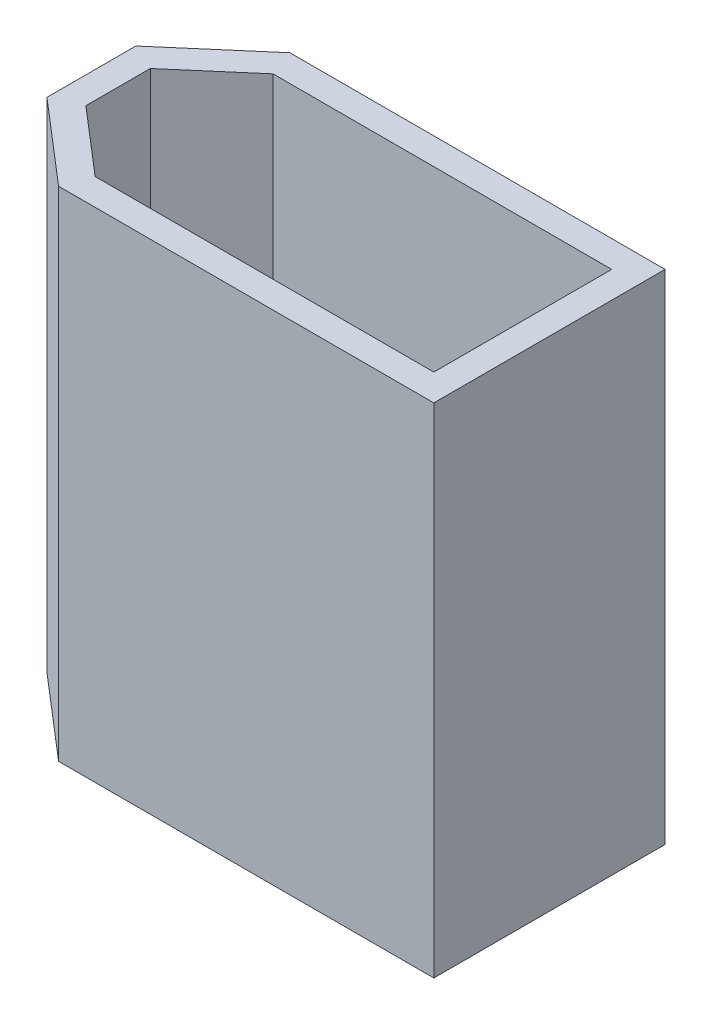
ISO-10303-21;
HEADER;
FILE_DESCRIPTION(('STEP AP214'),'2;1');
FILE_NAME('part.step','',(''),(''),'','','');
FILE_SCHEMA(('AUTOMOTIVE_DESIGN { 1 0 10303 214 1 1 1 1 }'));
ENDSEC;
DATA;
#1=APPLICATION_CONTEXT('core data for automotive mechanical design processes');
#2=APPLICATION_PROTOCOL_DEFINITION('international standard','automotive_design',2000,#1);
#3=PRODUCT_CONTEXT('',#1,'mechanical');
#4=PRODUCT('Part','Part','',(#3));
#5=PRODUCT_RELATED_PRODUCT_CATEGORY('part','',(#4));
#6=PRODUCT_DEFINITION_FORMATION('','',#4);
#7=PRODUCT_DEFINITION_CONTEXT('part definition',#1,'design');
#8=PRODUCT_DEFINITION('design','',#6,#7);
#9=PRODUCT_DEFINITION_SHAPE('','',#8);
#10=(LENGTH_UNIT() NAMED_UNIT(*) SI_UNIT(.MILLI.,.METRE.));
#11=(NAMED_UNIT(*) PLANE_ANGLE_UNIT() SI_UNIT($,.RADIAN.));
#12=(NAMED_UNIT(*) SI_UNIT($,.STERADIAN.) SOLID_ANGLE_UNIT());
#13=UNCERTAINTY_MEASURE_WITH_UNIT(LENGTH_MEASURE(1.E-05),#10,'distance_accuracy_value','');
#14=(GEOMETRIC_REPRESENTATION_CONTEXT(3) GLOBAL_UNCERTAINTY_ASSIGNED_CONTEXT((#13)) GLOBAL_UNIT_ASSIGNED_CONTEXT((#10,
#11,#12)) REPRESENTATION_CONTEXT('',''));
#15=CARTESIAN_POINT('',(0.,0.,0.));
#16=DIRECTION('',(0.,0.,1.));
#17=DIRECTION('',(1.,0.,0.));
#18=AXIS2_PLACEMENT_3D('',#15,#16,#17);
#19=CARTESIAN_POINT('',(0.,11.2,0.));
#20=DIRECTION('',(0.,1.,0.));
#21=DIRECTION('',(0.,0.,1.));
#22=AXIS2_PLACEMENT_3D('',#19,#20,#21);
#23=PLANE('',#22);
#24=DIRECTION('',(0.,0.,-1.));
#25=VECTOR('',#24,1.);
#26=CARTESIAN_POINT('',(5.15,11.2,2.6));
#27=LINE('',#26,#25);
#28=CARTESIAN_POINT('',(5.15,11.2,2.6));
#29=VERTEX_POINT('',#28);
#30=CARTESIAN_POINT('',(5.15,11.2,-2.6));
#31=VERTEX_POINT('',#30);
#32=EDGE_CURVE('E174',#29,#31,#27,.T.);
#33=ORIENTED_EDGE('',*,*,#32,.T.);
#34=DIRECTION('',(-1.,0.,0.));
#35=VECTOR('',#34,1.);
#36=CARTESIAN_POINT('',(5.15,11.2,-2.6));
#37=LINE('',#36,#35);
#38=CARTESIAN_POINT('',(-3.28806115864613,11.2,-2.6));
#39=VERTEX_POINT('',#38);
#40=EDGE_CURVE('E177',#31,#39,#37,.T.);
#41=ORIENTED_EDGE('',*,*,#40,.T.);
#42=DIRECTION('',(-0.758440361342966,0.,0.651742447816583));
#43=VECTOR('',#42,1.);
#44=CARTESIAN_POINT('',(-3.28806115864613,11.2,-2.6));
#45=LINE('',#44,#43);
#46=CARTESIAN_POINT('',(-5.15,11.2,-1.));
#47=VERTEX_POINT('',#46);
#48=EDGE_CURVE('E180',#39,#47,#45,.T.);
#49=ORIENTED_EDGE('',*,*,#48,.T.);
#50=DIRECTION('',(0.,0.,1.));
#51=VECTOR('',#50,1.);
#52=CARTESIAN_POINT('',(-5.15,11.2,1.));
#53=LINE('',#52,#51);
#54=CARTESIAN_POINT('',(-5.15,11.2,1.));
#55=VERTEX_POINT('',#54);
#56=EDGE_CURVE('E182',#47,#55,#53,.T.);
#57=ORIENTED_EDGE('',*,*,#56,.T.);
#58=DIRECTION('',(0.758440361342965,0.,0.651742447816583));
#59=VECTOR('',#58,1.);
#60=CARTESIAN_POINT('',(-3.28806115864613,11.2,2.6));
#61=LINE('',#60,#59);
#62=CARTESIAN_POINT('',(-3.28806115864613,11.2,2.6));
#63=VERTEX_POINT('',#62);
#64=EDGE_CURVE('E184',#55,#63,#61,.T.);
#65=ORIENTED_EDGE('',*,*,#64,.T.);
#66=DIRECTION('',(1.,0.,0.));
#67=VECTOR('',#66,1.);
#68=CARTESIAN_POINT('',(5.15,11.2,2.6));
#69=LINE('',#68,#67);
#70=EDGE_CURVE('E186',#63,#29,#69,.T.);
#71=ORIENTED_EDGE('',*,*,#70,.T.);
#72=EDGE_LOOP('',(#33,#41,#49,#57,#65,#71));
#73=FACE_BOUND('',#72,.T.);
#74=DIRECTION('',(-1.,0.,0.));
#75=VECTOR('',#74,1.);
#76=CARTESIAN_POINT('',(4.55,11.2,-2.));
#77=LINE('',#76,#75);
#78=CARTESIAN_POINT('',(4.55,11.2,-2.));
#79=VERTEX_POINT('',#78);
#80=CARTESIAN_POINT('',(-3.06567916760078,11.2,-2.));
#81=VERTEX_POINT('',#80);
#82=EDGE_CURVE('E131',#79,#81,#77,.T.);
#83=ORIENTED_EDGE('',*,*,#82,.F.);
#84=DIRECTION('',(0.,0.,-1.));
#85=VECTOR('',#84,1.);
#86=CARTESIAN_POINT('',(4.55,11.2,2.));
#87=LINE('',#86,#85);
#88=CARTESIAN_POINT('',(4.55,11.2,2.));
#89=VERTEX_POINT('',#88);
#90=EDGE_CURVE('E123',#89,#79,#87,.T.);
#91=ORIENTED_EDGE('',*,*,#90,.F.);
#92=DIRECTION('',(1.,0.,0.));
#93=VECTOR('',#92,1.);
#94=CARTESIAN_POINT('',(4.55,11.2,2.));
#95=LINE('',#94,#93);
#96=CARTESIAN_POINT('',(-3.06567916760078,11.2,2.));
#97=VERTEX_POINT('',#96);
#98=EDGE_CURVE('E152',#97,#89,#95,.T.);
#99=ORIENTED_EDGE('',*,*,#98,.F.);
#100=DIRECTION('',(0.758440361342966,0.,0.651742447816583));
#101=VECTOR('',#100,1.);
#102=CARTESIAN_POINT('',(-3.06567916760078,11.2,2.));
#103=LINE('',#102,#101);
#104=CARTESIAN_POINT('',(-4.55,11.2,0.724494446814439));
#105=VERTEX_POINT('',#104);
#106=EDGE_CURVE('E150',#105,#97,#103,.T.);
#107=ORIENTED_EDGE('',*,*,#106,.F.);
#108=DIRECTION('',(0.,0.,1.));
#109=VECTOR('',#108,1.);
#110=CARTESIAN_POINT('',(-4.55,11.2,0.724494446814439));
#111=LINE('',#110,#109);
#112=CARTESIAN_POINT('',(-4.55,11.2,-0.72449444681444));
#113=VERTEX_POINT('',#112);
#114=EDGE_CURVE('E146',#113,#105,#111,.T.);
#115=ORIENTED_EDGE('',*,*,#114,.F.);
#116=DIRECTION('',(-0.758440361342966,0.,0.651742447816583));
#117=VECTOR('',#116,1.);
#118=CARTESIAN_POINT('',(-3.06567916760078,11.2,-2.));
#119=LINE('',#118,#117);
#120=EDGE_CURVE('E144',#81,#113,#119,.T.);
#121=ORIENTED_EDGE('',*,*,#120,.F.);
#122=EDGE_LOOP('',(#83,#91,#99,#107,#115,#121));
#123=FACE_BOUND('',#122,.T.);
#124=ADVANCED_FACE('F34',(#73,#123),#23,.T.);
#125=CARTESIAN_POINT('',(0.,0.,0.));
#126=DIRECTION('',(0.,1.,0.));
#127=DIRECTION('',(0.,0.,1.));
#128=AXIS2_PLACEMENT_3D('',#125,#126,#127);
#129=PLANE('',#128);
#130=DIRECTION('',(0.,0.,-1.));
#131=VECTOR('',#130,1.);
#132=CARTESIAN_POINT('',(5.15,0.,2.6));
#133=LINE('',#132,#131);
#134=CARTESIAN_POINT('',(5.15,0.,2.6));
#135=VERTEX_POINT('',#134);
#136=CARTESIAN_POINT('',(5.15,0.,-2.6));
#137=VERTEX_POINT('',#136);
#138=EDGE_CURVE('E139',#135,#137,#133,.T.);
#139=ORIENTED_EDGE('',*,*,#138,.F.);
#140=DIRECTION('',(1.,0.,0.));
#141=VECTOR('',#140,1.);
#142=CARTESIAN_POINT('',(5.15,0.,2.6));
#143=LINE('',#142,#141);
#144=CARTESIAN_POINT('',(-3.28806115864613,0.,2.6));
#145=VERTEX_POINT('',#144);
#146=EDGE_CURVE('E178',#145,#135,#143,.T.);
#147=ORIENTED_EDGE('',*,*,#146,.F.);
#148=DIRECTION('',(0.758440361342965,0.,0.651742447816583));
#149=VECTOR('',#148,1.);
#150=CARTESIAN_POINT('',(-3.28806115864613,0.,2.6));
#151=LINE('',#150,#149);
#152=CARTESIAN_POINT('',(-5.15,0.,1.));
#153=VERTEX_POINT('',#152);
#154=EDGE_CURVE('E197',#153,#145,#151,.T.);
#155=ORIENTED_EDGE('',*,*,#154,.F.);
#156=DIRECTION('',(0.,0.,1.));
#157=VECTOR('',#156,1.);
#158=CARTESIAN_POINT('',(-5.15,0.,1.));
#159=LINE('',#158,#157);
#160=CARTESIAN_POINT('',(-5.15,0.,-1.));
#161=VERTEX_POINT('',#160);
#162=EDGE_CURVE('E195',#161,#153,#159,.T.);
#163=ORIENTED_EDGE('',*,*,#162,.F.);
#164=DIRECTION('',(-0.758440361342966,0.,0.651742447816583));
#165=VECTOR('',#164,1.);
#166=CARTESIAN_POINT('',(-3.28806115864613,0.,-2.6));
#167=LINE('',#166,#165);
#168=CARTESIAN_POINT('',(-3.28806115864613,0.,-2.6));
#169=VERTEX_POINT('',#168);
#170=EDGE_CURVE('E193',#169,#161,#167,.T.);
#171=ORIENTED_EDGE('',*,*,#170,.F.);
#172=DIRECTION('',(-1.,0.,0.));
#173=VECTOR('',#172,1.);
#174=CARTESIAN_POINT('',(5.15,0.,-2.6));
#175=LINE('',#174,#173);
#176=EDGE_CURVE('E191',#137,#169,#175,.T.);
#177=ORIENTED_EDGE('',*,*,#176,.F.);
#178=EDGE_LOOP('',(#139,#147,#155,#163,#171,#177));
#179=FACE_BOUND('',#178,.T.);
#180=DIRECTION('',(0.,0.,-1.));
#181=VECTOR('',#180,1.);
#182=CARTESIAN_POINT('',(4.55,0.,2.));
#183=LINE('',#182,#181);
#184=CARTESIAN_POINT('',(4.55,0.,2.));
#185=VERTEX_POINT('',#184);
#186=CARTESIAN_POINT('',(4.55,0.,-2.));
#187=VERTEX_POINT('',#186);
#188=EDGE_CURVE('E57',#185,#187,#183,.T.);
#189=ORIENTED_EDGE('',*,*,#188,.T.);
#190=DIRECTION('',(-1.,0.,0.));
#191=VECTOR('',#190,1.);
#192=CARTESIAN_POINT('',(4.55,0.,-2.));
#193=LINE('',#192,#191);
#194=CARTESIAN_POINT('',(-3.06567916760078,0.,-2.));
#195=VERTEX_POINT('',#194);
#196=EDGE_CURVE('E138',#187,#195,#193,.T.);
#197=ORIENTED_EDGE('',*,*,#196,.T.);
#198=DIRECTION('',(-0.758440361342966,0.,0.651742447816583));
#199=VECTOR('',#198,1.);
#200=CARTESIAN_POINT('',(-3.06567916760078,0.,-2.));
#201=LINE('',#200,#199);
#202=CARTESIAN_POINT('',(-4.55,0.,-0.72449444681444));
#203=VERTEX_POINT('',#202);
#204=EDGE_CURVE('E156',#195,#203,#201,.T.);
#205=ORIENTED_EDGE('',*,*,#204,.T.);
#206=DIRECTION('',(0.,0.,1.));
#207=VECTOR('',#206,1.);
#208=CARTESIAN_POINT('',(-4.55,0.,0.724494446814439));
#209=LINE('',#208,#207);
#210=CARTESIAN_POINT('',(-4.55,0.,0.724494446814439));
#211=VERTEX_POINT('',#210);
#212=EDGE_CURVE('E159',#203,#211,#209,.T.);
#213=ORIENTED_EDGE('',*,*,#212,.T.);
#214=DIRECTION('',(0.758440361342966,0.,0.651742447816583));
#215=VECTOR('',#214,1.);
#216=CARTESIAN_POINT('',(-3.06567916760078,0.,2.));
#217=LINE('',#216,#215);
#218=CARTESIAN_POINT('',(-3.06567916760078,0.,2.));
#219=VERTEX_POINT('',#218);
#220=EDGE_CURVE('E162',#211,#219,#217,.T.);
#221=ORIENTED_EDGE('',*,*,#220,.T.);
#222=DIRECTION('',(1.,0.,0.));
#223=VECTOR('',#222,1.);
#224=CARTESIAN_POINT('',(4.55,0.,2.));
#225=LINE('',#224,#223);
#226=EDGE_CURVE('E132',#219,#185,#225,.T.);
#227=ORIENTED_EDGE('',*,*,#226,.T.);
#228=EDGE_LOOP('',(#189,#197,#205,#213,#221,#227));
#229=FACE_BOUND('',#228,.T.);
#230=ADVANCED_FACE('F221',(#179,#229),#129,.F.);
#231=CARTESIAN_POINT('',(5.15,11.2,2.6));
#232=DIRECTION('',(-1.,0.,0.));
#233=DIRECTION('',(0.,0.,1.));
#234=AXIS2_PLACEMENT_3D('',#231,#232,#233);
#235=PLANE('',#234);
#236=ORIENTED_EDGE('',*,*,#138,.T.);
#237=DIRECTION('',(0.,-1.,0.));
#238=VECTOR('',#237,1.);
#239=CARTESIAN_POINT('',(5.15,11.2,-2.6));
#240=LINE('',#239,#238);
#241=EDGE_CURVE('E11',#31,#137,#240,.T.);
#242=ORIENTED_EDGE('',*,*,#241,.F.);
#243=ORIENTED_EDGE('',*,*,#32,.F.);
#244=DIRECTION('',(0.,-1.,0.));
#245=VECTOR('',#244,1.);
#246=CARTESIAN_POINT('',(5.15,11.2,2.6));
#247=LINE('',#246,#245);
#248=EDGE_CURVE('E188',#29,#135,#247,.T.);
#249=ORIENTED_EDGE('',*,*,#248,.T.);
#250=EDGE_LOOP('',(#236,#242,#243,#249));
#251=FACE_BOUND('',#250,.T.);
#252=ADVANCED_FACE('F36',(#251),#235,.F.);
#253=CARTESIAN_POINT('',(5.15,11.2,-2.6));
#254=DIRECTION('',(0.,0.,1.));
#255=DIRECTION('',(1.,0.,0.));
#256=AXIS2_PLACEMENT_3D('',#253,#254,#255);
#257=PLANE('',#256);
#258=ORIENTED_EDGE('',*,*,#176,.T.);
#259=DIRECTION('',(0.,-1.,0.));
#260=VECTOR('',#259,1.);
#261=CARTESIAN_POINT('',(-3.28806115864613,11.2,-2.6));
#262=LINE('',#261,#260);
#263=EDGE_CURVE('E42',#39,#169,#262,.T.);
#264=ORIENTED_EDGE('',*,*,#263,.F.);
#265=ORIENTED_EDGE('',*,*,#40,.F.);
#266=ORIENTED_EDGE('',*,*,#241,.T.);
#267=EDGE_LOOP('',(#258,#264,#265,#266));
#268=FACE_BOUND('',#267,.T.);
#269=ADVANCED_FACE('F238',(#268),#257,.F.);
#270=CARTESIAN_POINT('',(-3.28806115864613,11.2,-2.6));
#271=DIRECTION('',(0.651742447816583,0.,0.758440361342966));
#272=DIRECTION('',(0.758440361342966,0.,-0.651742447816583));
#273=AXIS2_PLACEMENT_3D('',#270,#271,#272);
#274=PLANE('',#273);
#275=ORIENTED_EDGE('',*,*,#170,.T.);
#276=DIRECTION('',(0.,-1.,0.));
#277=VECTOR('',#276,1.);
#278=CARTESIAN_POINT('',(-5.15,11.2,-1.));
#279=LINE('',#278,#277);
#280=EDGE_CURVE('E208',#47,#161,#279,.T.);
#281=ORIENTED_EDGE('',*,*,#280,.F.);
#282=ORIENTED_EDGE('',*,*,#48,.F.);
#283=ORIENTED_EDGE('',*,*,#263,.T.);
#284=EDGE_LOOP('',(#275,#281,#282,#283));
#285=FACE_BOUND('',#284,.T.);
#286=ADVANCED_FACE('F215',(#285),#274,.F.);
#287=CARTESIAN_POINT('',(-5.15,11.2,1.));
#288=DIRECTION('',(1.,0.,0.));
#289=DIRECTION('',(0.,0.,-1.));
#290=AXIS2_PLACEMENT_3D('',#287,#288,#289);
#291=PLANE('',#290);
#292=ORIENTED_EDGE('',*,*,#162,.T.);
#293=DIRECTION('',(0.,-1.,0.));
#294=VECTOR('',#293,1.);
#295=CARTESIAN_POINT('',(-5.15,11.2,1.));
#296=LINE('',#295,#294);
#297=EDGE_CURVE('E205',#55,#153,#296,.T.);
#298=ORIENTED_EDGE('',*,*,#297,.F.);
#299=ORIENTED_EDGE('',*,*,#56,.F.);
#300=ORIENTED_EDGE('',*,*,#280,.T.);
#301=EDGE_LOOP('',(#292,#298,#299,#300));
#302=FACE_BOUND('',#301,.T.);
#303=ADVANCED_FACE('F227',(#302),#291,.F.);
#304=CARTESIAN_POINT('',(-3.28806115864613,11.2,2.6));
#305=DIRECTION('',(0.651742447816584,0.,-0.758440361342966));
#306=DIRECTION('',(-0.758440361342965,0.,-0.651742447816583));
#307=AXIS2_PLACEMENT_3D('',#304,#305,#306);
#308=PLANE('',#307);
#309=ORIENTED_EDGE('',*,*,#154,.T.);
#310=DIRECTION('',(0.,-1.,0.));
#311=VECTOR('',#310,1.);
#312=CARTESIAN_POINT('',(-3.28806115864613,11.2,2.6));
#313=LINE('',#312,#311);
#314=EDGE_CURVE('E202',#63,#145,#313,.T.);
#315=ORIENTED_EDGE('',*,*,#314,.F.);
#316=ORIENTED_EDGE('',*,*,#64,.F.);
#317=ORIENTED_EDGE('',*,*,#297,.T.);
#318=EDGE_LOOP('',(#309,#315,#316,#317));
#319=FACE_BOUND('',#318,.T.);
#320=ADVANCED_FACE('F231',(#319),#308,.F.);
#321=CARTESIAN_POINT('',(5.15,11.2,2.6));
#322=DIRECTION('',(0.,0.,-1.));
#323=DIRECTION('',(-1.,0.,0.));
#324=AXIS2_PLACEMENT_3D('',#321,#322,#323);
#325=PLANE('',#324);
#326=ORIENTED_EDGE('',*,*,#146,.T.);
#327=ORIENTED_EDGE('',*,*,#248,.F.);
#328=ORIENTED_EDGE('',*,*,#70,.F.);
#329=ORIENTED_EDGE('',*,*,#314,.T.);
#330=EDGE_LOOP('',(#326,#327,#328,#329));
#331=FACE_BOUND('',#330,.T.);
#332=ADVANCED_FACE('F241',(#331),#325,.F.);
#333=CARTESIAN_POINT('',(4.55,11.2,2.));
#334=DIRECTION('',(-1.,0.,0.));
#335=DIRECTION('',(0.,0.,1.));
#336=AXIS2_PLACEMENT_3D('',#333,#334,#335);
#337=PLANE('',#336);
#338=ORIENTED_EDGE('',*,*,#188,.F.);
#339=DIRECTION('',(0.,-1.,0.));
#340=VECTOR('',#339,1.);
#341=CARTESIAN_POINT('',(4.55,11.2,2.));
#342=LINE('',#341,#340);
#343=EDGE_CURVE('E127',#89,#185,#342,.T.);
#344=ORIENTED_EDGE('',*,*,#343,.F.);
#345=ORIENTED_EDGE('',*,*,#90,.T.);
#346=DIRECTION('',(0.,-1.,0.));
#347=VECTOR('',#346,1.);
#348=CARTESIAN_POINT('',(4.55,11.2,-2.));
#349=LINE('',#348,#347);
#350=EDGE_CURVE('E126',#79,#187,#349,.T.);
#351=ORIENTED_EDGE('',*,*,#350,.T.);
#352=EDGE_LOOP('',(#338,#344,#345,#351));
#353=FACE_BOUND('',#352,.T.);
#354=ADVANCED_FACE('F125',(#353),#337,.T.);
#355=CARTESIAN_POINT('',(4.55,11.2,-2.));
#356=DIRECTION('',(0.,0.,1.));
#357=DIRECTION('',(1.,0.,0.));
#358=AXIS2_PLACEMENT_3D('',#355,#356,#357);
#359=PLANE('',#358);
#360=ORIENTED_EDGE('',*,*,#196,.F.);
#361=ORIENTED_EDGE('',*,*,#350,.F.);
#362=ORIENTED_EDGE('',*,*,#82,.T.);
#363=DIRECTION('',(0.,-1.,0.));
#364=VECTOR('',#363,1.);
#365=CARTESIAN_POINT('',(-3.06567916760078,11.2,-2.));
#366=LINE('',#365,#364);
#367=EDGE_CURVE('E140',#81,#195,#366,.T.);
#368=ORIENTED_EDGE('',*,*,#367,.T.);
#369=EDGE_LOOP('',(#360,#361,#362,#368));
#370=FACE_BOUND('',#369,.T.);
#371=ADVANCED_FACE('F135',(#370),#359,.T.);
#372=CARTESIAN_POINT('',(-3.06567916760078,11.2,-2.));
#373=DIRECTION('',(0.651742447816583,0.,0.758440361342966));
#374=DIRECTION('',(0.758440361342966,0.,-0.651742447816583));
#375=AXIS2_PLACEMENT_3D('',#372,#373,#374);
#376=PLANE('',#375);
#377=ORIENTED_EDGE('',*,*,#204,.F.);
#378=ORIENTED_EDGE('',*,*,#367,.F.);
#379=ORIENTED_EDGE('',*,*,#120,.T.);
#380=DIRECTION('',(0.,-1.,0.));
#381=VECTOR('',#380,1.);
#382=CARTESIAN_POINT('',(-4.55,11.2,-0.72449444681444));
#383=LINE('',#382,#381);
#384=EDGE_CURVE('E171',#113,#203,#383,.T.);
#385=ORIENTED_EDGE('',*,*,#384,.T.);
#386=EDGE_LOOP('',(#377,#378,#379,#385));
#387=FACE_BOUND('',#386,.T.);
#388=ADVANCED_FACE('F259',(#387),#376,.T.);
#389=CARTESIAN_POINT('',(-4.55,11.2,0.724494446814439));
#390=DIRECTION('',(1.,0.,0.));
#391=DIRECTION('',(0.,0.,-1.));
#392=AXIS2_PLACEMENT_3D('',#389,#390,#391);
#393=PLANE('',#392);
#394=ORIENTED_EDGE('',*,*,#212,.F.);
#395=ORIENTED_EDGE('',*,*,#384,.F.);
#396=ORIENTED_EDGE('',*,*,#114,.T.);
#397=DIRECTION('',(0.,-1.,0.));
#398=VECTOR('',#397,1.);
#399=CARTESIAN_POINT('',(-4.55,11.2,0.724494446814439));
#400=LINE('',#399,#398);
#401=EDGE_CURVE('E169',#105,#211,#400,.T.);
#402=ORIENTED_EDGE('',*,*,#401,.T.);
#403=EDGE_LOOP('',(#394,#395,#396,#402));
#404=FACE_BOUND('',#403,.T.);
#405=ADVANCED_FACE('F262',(#404),#393,.T.);
#406=CARTESIAN_POINT('',(-3.06567916760078,11.2,2.));
#407=DIRECTION('',(0.651742447816584,0.,-0.758440361342966));
#408=DIRECTION('',(-0.758440361342965,0.,-0.651742447816583));
#409=AXIS2_PLACEMENT_3D('',#406,#407,#408);
#410=PLANE('',#409);
#411=ORIENTED_EDGE('',*,*,#220,.F.);
#412=ORIENTED_EDGE('',*,*,#401,.F.);
#413=ORIENTED_EDGE('',*,*,#106,.T.);
#414=DIRECTION('',(0.,-1.,0.));
#415=VECTOR('',#414,1.);
#416=CARTESIAN_POINT('',(-3.06567916760078,11.2,2.));
#417=LINE('',#416,#415);
#418=EDGE_CURVE('E49',#97,#219,#417,.T.);
#419=ORIENTED_EDGE('',*,*,#418,.T.);
#420=EDGE_LOOP('',(#411,#412,#413,#419));
#421=FACE_BOUND('',#420,.T.);
#422=ADVANCED_FACE('F266',(#421),#410,.T.);
#423=CARTESIAN_POINT('',(4.55,11.2,2.));
#424=DIRECTION('',(0.,0.,-1.));
#425=DIRECTION('',(-1.,0.,0.));
#426=AXIS2_PLACEMENT_3D('',#423,#424,#425);
#427=PLANE('',#426);
#428=ORIENTED_EDGE('',*,*,#226,.F.);
#429=ORIENTED_EDGE('',*,*,#418,.F.);
#430=ORIENTED_EDGE('',*,*,#98,.T.);
#431=ORIENTED_EDGE('',*,*,#343,.T.);
#432=EDGE_LOOP('',(#428,#429,#430,#431));
#433=FACE_BOUND('',#432,.T.);
#434=ADVANCED_FACE('F270',(#433),#427,.T.);
#435=CLOSED_SHELL('',(#124,#230,#252,#269,#286,#303,#320,#332,#354,#371,#388,#405,#422,#434));
#436=MANIFOLD_SOLID_BREP('B2',#435);
#437=ADVANCED_BREP_SHAPE_REPRESENTATION('',(#18,#436),#14);
#438=SHAPE_DEFINITION_REPRESENTATION(#9,#437);
ENDSEC;
END-ISO-10303-21;
